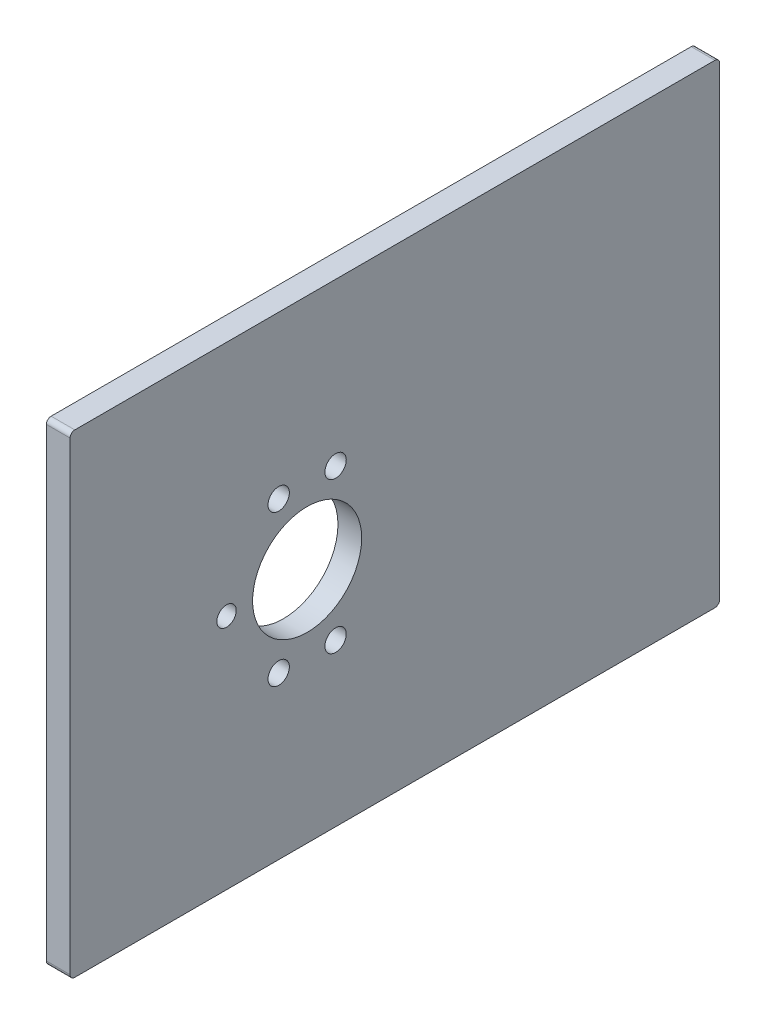
ISO-10303-21;
HEADER;
FILE_DESCRIPTION(('STEP AP214'),'2;1');
FILE_NAME('part.step','',(''),(''),'','','');
FILE_SCHEMA(('AUTOMOTIVE_DESIGN { 1 0 10303 214 1 1 1 1 }'));
ENDSEC;
DATA;
#1=APPLICATION_CONTEXT('core data for automotive mechanical design processes');
#2=APPLICATION_PROTOCOL_DEFINITION('international standard','automotive_design',2000,#1);
#3=PRODUCT_CONTEXT('',#1,'mechanical');
#4=PRODUCT('Part','Part','',(#3));
#5=PRODUCT_RELATED_PRODUCT_CATEGORY('part','',(#4));
#6=PRODUCT_DEFINITION_FORMATION('','',#4);
#7=PRODUCT_DEFINITION_CONTEXT('part definition',#1,'design');
#8=PRODUCT_DEFINITION('design','',#6,#7);
#9=PRODUCT_DEFINITION_SHAPE('','',#8);
#10=(LENGTH_UNIT() NAMED_UNIT(*) SI_UNIT(.MILLI.,.METRE.));
#11=(NAMED_UNIT(*) PLANE_ANGLE_UNIT() SI_UNIT($,.RADIAN.));
#12=(NAMED_UNIT(*) SI_UNIT($,.STERADIAN.) SOLID_ANGLE_UNIT());
#13=UNCERTAINTY_MEASURE_WITH_UNIT(LENGTH_MEASURE(1.E-05),#10,'distance_accuracy_value','');
#14=(GEOMETRIC_REPRESENTATION_CONTEXT(3) GLOBAL_UNCERTAINTY_ASSIGNED_CONTEXT((#13)) GLOBAL_UNIT_ASSIGNED_CONTEXT((#10,
#11,#12)) REPRESENTATION_CONTEXT('',''));
#15=CARTESIAN_POINT('',(0.,0.,0.));
#16=DIRECTION('',(0.,0.,1.));
#17=DIRECTION('',(1.,0.,0.));
#18=AXIS2_PLACEMENT_3D('',#15,#16,#17);
#19=CARTESIAN_POINT('',(5.,0.,0.));
#20=DIRECTION('',(-1.,0.,0.));
#21=DIRECTION('',(0.,0.,1.));
#22=AXIS2_PLACEMENT_3D('',#19,#20,#21);
#23=PLANE('',#22);
#24=DIRECTION('',(0.,1.,0.));
#25=VECTOR('',#24,1.);
#26=CARTESIAN_POINT('',(5.,-40.0918034275328,55.));
#27=LINE('',#26,#25);
#28=CARTESIAN_POINT('',(5.,-39.0918034275328,55.));
#29=VERTEX_POINT('',#28);
#30=CARTESIAN_POINT('',(5.,58.9081965724673,55.));
#31=VERTEX_POINT('',#30);
#32=EDGE_CURVE('E172',#29,#31,#27,.T.);
#33=ORIENTED_EDGE('',*,*,#32,.T.);
#34=CARTESIAN_POINT('',(5.,58.9081965724673,56.));
#35=DIRECTION('',(-1.,0.,0.));
#36=DIRECTION('',(0.,0.,1.));
#37=AXIS2_PLACEMENT_3D('',#34,#35,#36);
#38=CIRCLE('',#37,1.);
#39=CARTESIAN_POINT('',(5.,59.9081965724673,56.));
#40=VERTEX_POINT('',#39);
#41=EDGE_CURVE('E149',#31,#40,#38,.F.);
#42=ORIENTED_EDGE('',*,*,#41,.T.);
#43=DIRECTION('',(0.,0.,1.));
#44=VECTOR('',#43,1.);
#45=CARTESIAN_POINT('',(5.,59.9081965724673,92.));
#46=LINE('',#45,#44);
#47=CARTESIAN_POINT('',(5.,59.9081965724673,191.));
#48=VERTEX_POINT('',#47);
#49=EDGE_CURVE('E120',#40,#48,#46,.T.);
#50=ORIENTED_EDGE('',*,*,#49,.T.);
#51=CARTESIAN_POINT('',(5.,58.9081965724672,191.));
#52=DIRECTION('',(-1.,0.,0.));
#53=DIRECTION('',(0.,0.,1.));
#54=AXIS2_PLACEMENT_3D('',#51,#52,#53);
#55=CIRCLE('',#54,1.);
#56=CARTESIAN_POINT('',(5.,58.9081965724672,192.));
#57=VERTEX_POINT('',#56);
#58=EDGE_CURVE('E145',#48,#57,#55,.F.);
#59=ORIENTED_EDGE('',*,*,#58,.T.);
#60=DIRECTION('',(0.,-1.,0.));
#61=VECTOR('',#60,1.);
#62=CARTESIAN_POINT('',(5.,59.9081965724672,192.));
#63=LINE('',#62,#61);
#64=CARTESIAN_POINT('',(5.,-39.0918034275328,192.));
#65=VERTEX_POINT('',#64);
#66=EDGE_CURVE('E128',#57,#65,#63,.T.);
#67=ORIENTED_EDGE('',*,*,#66,.T.);
#68=CARTESIAN_POINT('',(5.,-39.0918034275328,191.));
#69=DIRECTION('',(-1.,0.,0.));
#70=DIRECTION('',(0.,0.,1.));
#71=AXIS2_PLACEMENT_3D('',#68,#69,#70);
#72=CIRCLE('',#71,1.);
#73=CARTESIAN_POINT('',(5.,-40.0918034275328,191.));
#74=VERTEX_POINT('',#73);
#75=EDGE_CURVE('E55',#65,#74,#72,.F.);
#76=ORIENTED_EDGE('',*,*,#75,.T.);
#77=DIRECTION('',(0.,0.,-1.));
#78=VECTOR('',#77,1.);
#79=CARTESIAN_POINT('',(5.,-40.0918034275328,92.));
#80=LINE('',#79,#78);
#81=CARTESIAN_POINT('',(5.,-40.0918034275328,56.));
#82=VERTEX_POINT('',#81);
#83=EDGE_CURVE('E131',#74,#82,#80,.T.);
#84=ORIENTED_EDGE('',*,*,#83,.T.);
#85=CARTESIAN_POINT('',(5.,-39.0918034275328,56.));
#86=DIRECTION('',(-1.,0.,0.));
#87=DIRECTION('',(0.,0.,1.));
#88=AXIS2_PLACEMENT_3D('',#85,#86,#87);
#89=CIRCLE('',#88,1.);
#90=EDGE_CURVE('E147',#82,#29,#89,.F.);
#91=ORIENTED_EDGE('',*,*,#90,.T.);
#92=EDGE_LOOP('',(#33,#42,#50,#59,#67,#76,#84,#91));
#93=FACE_BOUND('',#92,.T.);
#94=CARTESIAN_POINT('',(5.,9.90819657246723,142.));
#95=DIRECTION('',(1.,0.,0.));
#96=DIRECTION('',(0.,0.,-1.));
#97=AXIS2_PLACEMENT_3D('',#94,#95,#96);
#98=CIRCLE('',#97,11.5);
#99=CARTESIAN_POINT('',(5.,9.90819657246723,130.5));
#100=VERTEX_POINT('',#99);
#101=EDGE_CURVE('E168',#100,#100,#98,.T.);
#102=ORIENTED_EDGE('',*,*,#101,.F.);
#103=EDGE_LOOP('',(#102));
#104=FACE_BOUND('',#103,.T.);
#105=CARTESIAN_POINT('',(5.,25.8141702930541,148.));
#106=DIRECTION('',(1.,0.,0.));
#107=DIRECTION('',(0.,0.,-1.));
#108=AXIS2_PLACEMENT_3D('',#105,#106,#107);
#109=CIRCLE('',#108,2.25000000000001);
#110=CARTESIAN_POINT('',(5.,25.8141702930541,145.75));
#111=VERTEX_POINT('',#110);
#112=EDGE_CURVE('E178',#111,#111,#109,.T.);
#113=ORIENTED_EDGE('',*,*,#112,.F.);
#114=EDGE_LOOP('',(#113));
#115=FACE_BOUND('',#114,.T.);
#116=CARTESIAN_POINT('',(5.,25.8141702930541,136.));
#117=DIRECTION('',(1.,0.,0.));
#118=DIRECTION('',(0.,0.,-1.));
#119=AXIS2_PLACEMENT_3D('',#116,#117,#118);
#120=CIRCLE('',#119,2.25000000000001);
#121=CARTESIAN_POINT('',(5.,25.8141702930541,133.75));
#122=VERTEX_POINT('',#121);
#123=EDGE_CURVE('E184',#122,#122,#120,.T.);
#124=ORIENTED_EDGE('',*,*,#123,.F.);
#125=EDGE_LOOP('',(#124));
#126=FACE_BOUND('',#125,.T.);
#127=CARTESIAN_POINT('',(5.,9.90819657246723,159.));
#128=DIRECTION('',(1.,0.,0.));
#129=DIRECTION('',(0.,0.,-1.));
#130=AXIS2_PLACEMENT_3D('',#127,#128,#129);
#131=CIRCLE('',#130,2.04999999999999);
#132=CARTESIAN_POINT('',(5.,9.90819657246723,156.95));
#133=VERTEX_POINT('',#132);
#134=EDGE_CURVE('E190',#133,#133,#131,.T.);
#135=ORIENTED_EDGE('',*,*,#134,.F.);
#136=EDGE_LOOP('',(#135));
#137=FACE_BOUND('',#136,.T.);
#138=CARTESIAN_POINT('',(5.,-5.99777714811964,148.));
#139=DIRECTION('',(1.,0.,0.));
#140=DIRECTION('',(0.,0.,-1.));
#141=AXIS2_PLACEMENT_3D('',#138,#139,#140);
#142=CIRCLE('',#141,2.25000000000001);
#143=CARTESIAN_POINT('',(5.,-5.99777714811964,145.75));
#144=VERTEX_POINT('',#143);
#145=EDGE_CURVE('E196',#144,#144,#142,.T.);
#146=ORIENTED_EDGE('',*,*,#145,.F.);
#147=EDGE_LOOP('',(#146));
#148=FACE_BOUND('',#147,.T.);
#149=CARTESIAN_POINT('',(5.,-5.99777714811964,136.));
#150=DIRECTION('',(1.,0.,0.));
#151=DIRECTION('',(0.,0.,-1.));
#152=AXIS2_PLACEMENT_3D('',#149,#150,#151);
#153=CIRCLE('',#152,2.25000000000001);
#154=CARTESIAN_POINT('',(5.,-5.99777714811964,133.75));
#155=VERTEX_POINT('',#154);
#156=EDGE_CURVE('E202',#155,#155,#153,.T.);
#157=ORIENTED_EDGE('',*,*,#156,.F.);
#158=EDGE_LOOP('',(#157));
#159=FACE_BOUND('',#158,.T.);
#160=ADVANCED_FACE('F33',(#93,#104,#115,#126,#137,#148,#159),#23,.F.);
#161=CARTESIAN_POINT('',(0.,0.,0.));
#162=DIRECTION('',(-1.,0.,0.));
#163=DIRECTION('',(0.,0.,1.));
#164=AXIS2_PLACEMENT_3D('',#161,#162,#163);
#165=PLANE('',#164);
#166=CARTESIAN_POINT('',(0.,-5.99777714811964,148.));
#167=DIRECTION('',(1.,0.,0.));
#168=DIRECTION('',(0.,0.,-1.));
#169=AXIS2_PLACEMENT_3D('',#166,#167,#168);
#170=CIRCLE('',#169,2.25000000000001);
#171=CARTESIAN_POINT('',(0.,-5.99777714811964,145.75));
#172=VERTEX_POINT('',#171);
#173=EDGE_CURVE('E199',#172,#172,#170,.T.);
#174=ORIENTED_EDGE('',*,*,#173,.T.);
#175=EDGE_LOOP('',(#174));
#176=FACE_BOUND('',#175,.T.);
#177=CARTESIAN_POINT('',(0.,25.8141702930541,136.));
#178=DIRECTION('',(1.,0.,0.));
#179=DIRECTION('',(0.,0.,-1.));
#180=AXIS2_PLACEMENT_3D('',#177,#178,#179);
#181=CIRCLE('',#180,2.25000000000001);
#182=CARTESIAN_POINT('',(0.,25.8141702930541,133.75));
#183=VERTEX_POINT('',#182);
#184=EDGE_CURVE('E187',#183,#183,#181,.T.);
#185=ORIENTED_EDGE('',*,*,#184,.T.);
#186=EDGE_LOOP('',(#185));
#187=FACE_BOUND('',#186,.T.);
#188=CARTESIAN_POINT('',(0.,9.90819657246723,142.));
#189=DIRECTION('',(1.,0.,0.));
#190=DIRECTION('',(0.,0.,-1.));
#191=AXIS2_PLACEMENT_3D('',#188,#189,#190);
#192=CIRCLE('',#191,11.5);
#193=CARTESIAN_POINT('',(0.,9.90819657246723,130.5));
#194=VERTEX_POINT('',#193);
#195=EDGE_CURVE('E175',#194,#194,#192,.T.);
#196=ORIENTED_EDGE('',*,*,#195,.T.);
#197=EDGE_LOOP('',(#196));
#198=FACE_BOUND('',#197,.T.);
#199=DIRECTION('',(0.,0.,1.));
#200=VECTOR('',#199,1.);
#201=CARTESIAN_POINT('',(0.,59.9081965724673,92.));
#202=LINE('',#201,#200);
#203=CARTESIAN_POINT('',(0.,59.9081965724673,56.));
#204=VERTEX_POINT('',#203);
#205=CARTESIAN_POINT('',(0.,59.9081965724672,191.));
#206=VERTEX_POINT('',#205);
#207=EDGE_CURVE('E117',#204,#206,#202,.T.);
#208=ORIENTED_EDGE('',*,*,#207,.F.);
#209=CARTESIAN_POINT('',(0.,58.9081965724673,56.));
#210=DIRECTION('',(-1.,0.,0.));
#211=DIRECTION('',(0.,0.,1.));
#212=AXIS2_PLACEMENT_3D('',#209,#210,#211);
#213=CIRCLE('',#212,1.);
#214=CARTESIAN_POINT('',(0.,58.9081965724673,55.));
#215=VERTEX_POINT('',#214);
#216=EDGE_CURVE('E100',#204,#215,#213,.T.);
#217=ORIENTED_EDGE('',*,*,#216,.T.);
#218=DIRECTION('',(0.,1.,0.));
#219=VECTOR('',#218,1.);
#220=CARTESIAN_POINT('',(0.,-40.0918034275328,55.));
#221=LINE('',#220,#219);
#222=CARTESIAN_POINT('',(0.,-39.0918034275328,55.));
#223=VERTEX_POINT('',#222);
#224=EDGE_CURVE('E129',#223,#215,#221,.T.);
#225=ORIENTED_EDGE('',*,*,#224,.F.);
#226=CARTESIAN_POINT('',(0.,-39.0918034275328,56.));
#227=DIRECTION('',(-1.,0.,0.));
#228=DIRECTION('',(0.,0.,1.));
#229=AXIS2_PLACEMENT_3D('',#226,#227,#228);
#230=CIRCLE('',#229,1.);
#231=CARTESIAN_POINT('',(0.,-40.0918034275328,56.));
#232=VERTEX_POINT('',#231);
#233=EDGE_CURVE('E111',#223,#232,#230,.T.);
#234=ORIENTED_EDGE('',*,*,#233,.T.);
#235=DIRECTION('',(0.,0.,-1.));
#236=VECTOR('',#235,1.);
#237=CARTESIAN_POINT('',(0.,-40.0918034275328,92.));
#238=LINE('',#237,#236);
#239=CARTESIAN_POINT('',(0.,-40.0918034275328,191.));
#240=VERTEX_POINT('',#239);
#241=EDGE_CURVE('E133',#240,#232,#238,.T.);
#242=ORIENTED_EDGE('',*,*,#241,.F.);
#243=CARTESIAN_POINT('',(0.,-39.0918034275328,191.));
#244=DIRECTION('',(-1.,0.,0.));
#245=DIRECTION('',(0.,0.,1.));
#246=AXIS2_PLACEMENT_3D('',#243,#244,#245);
#247=CIRCLE('',#246,1.);
#248=CARTESIAN_POINT('',(0.,-39.0918034275328,192.));
#249=VERTEX_POINT('',#248);
#250=EDGE_CURVE('E121',#240,#249,#247,.T.);
#251=ORIENTED_EDGE('',*,*,#250,.T.);
#252=DIRECTION('',(0.,-1.,0.));
#253=VECTOR('',#252,1.);
#254=CARTESIAN_POINT('',(0.,59.9081965724672,192.));
#255=LINE('',#254,#253);
#256=CARTESIAN_POINT('',(0.,58.9081965724672,192.));
#257=VERTEX_POINT('',#256);
#258=EDGE_CURVE('E160',#257,#249,#255,.T.);
#259=ORIENTED_EDGE('',*,*,#258,.F.);
#260=CARTESIAN_POINT('',(0.,58.9081965724672,191.));
#261=DIRECTION('',(-1.,0.,0.));
#262=DIRECTION('',(0.,0.,1.));
#263=AXIS2_PLACEMENT_3D('',#260,#261,#262);
#264=CIRCLE('',#263,1.);
#265=EDGE_CURVE('E127',#257,#206,#264,.T.);
#266=ORIENTED_EDGE('',*,*,#265,.T.);
#267=EDGE_LOOP('',(#208,#217,#225,#234,#242,#251,#259,#266));
#268=FACE_BOUND('',#267,.T.);
#269=CARTESIAN_POINT('',(0.,25.8141702930541,148.));
#270=DIRECTION('',(1.,0.,0.));
#271=DIRECTION('',(0.,0.,-1.));
#272=AXIS2_PLACEMENT_3D('',#269,#270,#271);
#273=CIRCLE('',#272,2.25000000000001);
#274=CARTESIAN_POINT('',(0.,25.8141702930541,145.75));
#275=VERTEX_POINT('',#274);
#276=EDGE_CURVE('E181',#275,#275,#273,.T.);
#277=ORIENTED_EDGE('',*,*,#276,.T.);
#278=EDGE_LOOP('',(#277));
#279=FACE_BOUND('',#278,.T.);
#280=CARTESIAN_POINT('',(0.,9.90819657246723,159.));
#281=DIRECTION('',(1.,0.,0.));
#282=DIRECTION('',(0.,0.,-1.));
#283=AXIS2_PLACEMENT_3D('',#280,#281,#282);
#284=CIRCLE('',#283,2.04999999999999);
#285=CARTESIAN_POINT('',(0.,9.90819657246723,156.95));
#286=VERTEX_POINT('',#285);
#287=EDGE_CURVE('E193',#286,#286,#284,.T.);
#288=ORIENTED_EDGE('',*,*,#287,.T.);
#289=EDGE_LOOP('',(#288));
#290=FACE_BOUND('',#289,.T.);
#291=CARTESIAN_POINT('',(0.,-5.99777714811964,136.));
#292=DIRECTION('',(1.,0.,0.));
#293=DIRECTION('',(0.,0.,-1.));
#294=AXIS2_PLACEMENT_3D('',#291,#292,#293);
#295=CIRCLE('',#294,2.25000000000001);
#296=CARTESIAN_POINT('',(0.,-5.99777714811964,133.75));
#297=VERTEX_POINT('',#296);
#298=EDGE_CURVE('E205',#297,#297,#295,.T.);
#299=ORIENTED_EDGE('',*,*,#298,.T.);
#300=EDGE_LOOP('',(#299));
#301=FACE_BOUND('',#300,.T.);
#302=ADVANCED_FACE('F124',(#176,#187,#198,#268,#279,#290,#301),#165,.T.);
#303=CARTESIAN_POINT('',(5.,59.9081965724672,192.));
#304=DIRECTION('',(0.,0.,-1.));
#305=DIRECTION('',(-1.,0.,0.));
#306=AXIS2_PLACEMENT_3D('',#303,#304,#305);
#307=PLANE('',#306);
#308=ORIENTED_EDGE('',*,*,#66,.F.);
#309=DIRECTION('',(-1.,0.,0.));
#310=VECTOR('',#309,1.);
#311=CARTESIAN_POINT('',(5.,58.9081965724672,192.));
#312=LINE('',#311,#310);
#313=EDGE_CURVE('E11',#57,#257,#312,.T.);
#314=ORIENTED_EDGE('',*,*,#313,.T.);
#315=ORIENTED_EDGE('',*,*,#258,.T.);
#316=DIRECTION('',(-1.,0.,0.));
#317=VECTOR('',#316,1.);
#318=CARTESIAN_POINT('',(5.,-39.0918034275328,192.));
#319=LINE('',#318,#317);
#320=EDGE_CURVE('E41',#249,#65,#319,.F.);
#321=ORIENTED_EDGE('',*,*,#320,.T.);
#322=EDGE_LOOP('',(#308,#314,#315,#321));
#323=FACE_BOUND('',#322,.T.);
#324=ADVANCED_FACE('F158',(#323),#307,.F.);
#325=CARTESIAN_POINT('',(5.,-40.0918034275328,92.));
#326=DIRECTION('',(0.,1.,0.));
#327=DIRECTION('',(0.,0.,1.));
#328=AXIS2_PLACEMENT_3D('',#325,#326,#327);
#329=PLANE('',#328);
#330=ORIENTED_EDGE('',*,*,#241,.T.);
#331=DIRECTION('',(-1.,0.,0.));
#332=VECTOR('',#331,1.);
#333=CARTESIAN_POINT('',(5.,-40.0918034275328,56.));
#334=LINE('',#333,#332);
#335=EDGE_CURVE('E48',#232,#82,#334,.F.);
#336=ORIENTED_EDGE('',*,*,#335,.T.);
#337=ORIENTED_EDGE('',*,*,#83,.F.);
#338=DIRECTION('',(-1.,0.,0.));
#339=VECTOR('',#338,1.);
#340=CARTESIAN_POINT('',(5.,-40.0918034275328,191.));
#341=LINE('',#340,#339);
#342=EDGE_CURVE('E151',#74,#240,#341,.T.);
#343=ORIENTED_EDGE('',*,*,#342,.T.);
#344=EDGE_LOOP('',(#330,#336,#337,#343));
#345=FACE_BOUND('',#344,.T.);
#346=ADVANCED_FACE('F167',(#345),#329,.F.);
#347=CARTESIAN_POINT('',(5.,-40.0918034275328,55.));
#348=DIRECTION('',(0.,0.,1.));
#349=DIRECTION('',(1.,0.,0.));
#350=AXIS2_PLACEMENT_3D('',#347,#348,#349);
#351=PLANE('',#350);
#352=ORIENTED_EDGE('',*,*,#224,.T.);
#353=DIRECTION('',(-1.,0.,0.));
#354=VECTOR('',#353,1.);
#355=CARTESIAN_POINT('',(5.,58.9081965724673,55.));
#356=LINE('',#355,#354);
#357=EDGE_CURVE('E105',#215,#31,#356,.F.);
#358=ORIENTED_EDGE('',*,*,#357,.T.);
#359=ORIENTED_EDGE('',*,*,#32,.F.);
#360=DIRECTION('',(-1.,0.,0.));
#361=VECTOR('',#360,1.);
#362=CARTESIAN_POINT('',(5.,-39.0918034275328,55.));
#363=LINE('',#362,#361);
#364=EDGE_CURVE('E110',#29,#223,#363,.T.);
#365=ORIENTED_EDGE('',*,*,#364,.T.);
#366=EDGE_LOOP('',(#352,#358,#359,#365));
#367=FACE_BOUND('',#366,.T.);
#368=ADVANCED_FACE('F228',(#367),#351,.F.);
#369=CARTESIAN_POINT('',(5.,59.9081965724673,92.));
#370=DIRECTION('',(0.,-1.,0.));
#371=DIRECTION('',(0.,0.,-1.));
#372=AXIS2_PLACEMENT_3D('',#369,#370,#371);
#373=PLANE('',#372);
#374=ORIENTED_EDGE('',*,*,#49,.F.);
#375=DIRECTION('',(-1.,0.,0.));
#376=VECTOR('',#375,1.);
#377=CARTESIAN_POINT('',(5.,59.9081965724673,56.));
#378=LINE('',#377,#376);
#379=EDGE_CURVE('E104',#40,#204,#378,.T.);
#380=ORIENTED_EDGE('',*,*,#379,.T.);
#381=ORIENTED_EDGE('',*,*,#207,.T.);
#382=DIRECTION('',(-1.,0.,0.));
#383=VECTOR('',#382,1.);
#384=CARTESIAN_POINT('',(5.,59.9081965724672,191.));
#385=LINE('',#384,#383);
#386=EDGE_CURVE('E122',#206,#48,#385,.F.);
#387=ORIENTED_EDGE('',*,*,#386,.T.);
#388=EDGE_LOOP('',(#374,#380,#381,#387));
#389=FACE_BOUND('',#388,.T.);
#390=ADVANCED_FACE('F116',(#389),#373,.F.);
#391=CARTESIAN_POINT('',(5.,9.90819657246723,142.));
#392=DIRECTION('',(-1.,0.,0.));
#393=DIRECTION('',(0.,0.,1.));
#394=AXIS2_PLACEMENT_3D('',#391,#392,#393);
#395=CYLINDRICAL_SURFACE('',#394,11.5);
#396=ORIENTED_EDGE('',*,*,#101,.T.);
#397=EDGE_LOOP('',(#396));
#398=FACE_BOUND('',#397,.T.);
#399=ORIENTED_EDGE('',*,*,#195,.F.);
#400=EDGE_LOOP('',(#399));
#401=FACE_BOUND('',#400,.T.);
#402=ADVANCED_FACE('F223',(#398,#401),#395,.F.);
#403=CARTESIAN_POINT('',(5.,25.8141702930541,148.));
#404=DIRECTION('',(-1.,0.,0.));
#405=DIRECTION('',(0.,0.,1.));
#406=AXIS2_PLACEMENT_3D('',#403,#404,#405);
#407=CYLINDRICAL_SURFACE('',#406,2.25000000000001);
#408=ORIENTED_EDGE('',*,*,#112,.T.);
#409=EDGE_LOOP('',(#408));
#410=FACE_BOUND('',#409,.T.);
#411=ORIENTED_EDGE('',*,*,#276,.F.);
#412=EDGE_LOOP('',(#411));
#413=FACE_BOUND('',#412,.T.);
#414=ADVANCED_FACE('F320',(#410,#413),#407,.F.);
#415=CARTESIAN_POINT('',(5.,25.8141702930541,136.));
#416=DIRECTION('',(-1.,0.,0.));
#417=DIRECTION('',(0.,0.,1.));
#418=AXIS2_PLACEMENT_3D('',#415,#416,#417);
#419=CYLINDRICAL_SURFACE('',#418,2.25000000000001);
#420=ORIENTED_EDGE('',*,*,#123,.T.);
#421=EDGE_LOOP('',(#420));
#422=FACE_BOUND('',#421,.T.);
#423=ORIENTED_EDGE('',*,*,#184,.F.);
#424=EDGE_LOOP('',(#423));
#425=FACE_BOUND('',#424,.T.);
#426=ADVANCED_FACE('F328',(#422,#425),#419,.F.);
#427=CARTESIAN_POINT('',(5.,9.90819657246723,159.));
#428=DIRECTION('',(-1.,0.,0.));
#429=DIRECTION('',(0.,0.,1.));
#430=AXIS2_PLACEMENT_3D('',#427,#428,#429);
#431=CYLINDRICAL_SURFACE('',#430,2.04999999999999);
#432=ORIENTED_EDGE('',*,*,#134,.T.);
#433=EDGE_LOOP('',(#432));
#434=FACE_BOUND('',#433,.T.);
#435=ORIENTED_EDGE('',*,*,#287,.F.);
#436=EDGE_LOOP('',(#435));
#437=FACE_BOUND('',#436,.T.);
#438=ADVANCED_FACE('F336',(#434,#437),#431,.F.);
#439=CARTESIAN_POINT('',(5.,-5.99777714811964,148.));
#440=DIRECTION('',(-1.,0.,0.));
#441=DIRECTION('',(0.,0.,1.));
#442=AXIS2_PLACEMENT_3D('',#439,#440,#441);
#443=CYLINDRICAL_SURFACE('',#442,2.25000000000001);
#444=ORIENTED_EDGE('',*,*,#145,.T.);
#445=EDGE_LOOP('',(#444));
#446=FACE_BOUND('',#445,.T.);
#447=ORIENTED_EDGE('',*,*,#173,.F.);
#448=EDGE_LOOP('',(#447));
#449=FACE_BOUND('',#448,.T.);
#450=ADVANCED_FACE('F345',(#446,#449),#443,.F.);
#451=CARTESIAN_POINT('',(5.,-5.99777714811964,136.));
#452=DIRECTION('',(-1.,0.,0.));
#453=DIRECTION('',(0.,0.,1.));
#454=AXIS2_PLACEMENT_3D('',#451,#452,#453);
#455=CYLINDRICAL_SURFACE('',#454,2.25000000000001);
#456=ORIENTED_EDGE('',*,*,#156,.T.);
#457=EDGE_LOOP('',(#456));
#458=FACE_BOUND('',#457,.T.);
#459=ORIENTED_EDGE('',*,*,#298,.F.);
#460=EDGE_LOOP('',(#459));
#461=FACE_BOUND('',#460,.T.);
#462=ADVANCED_FACE('F211',(#458,#461),#455,.F.);
#463=CARTESIAN_POINT('',(5.,58.9081965724673,56.));
#464=DIRECTION('',(-1.,0.,0.));
#465=DIRECTION('',(0.,0.,1.));
#466=AXIS2_PLACEMENT_3D('',#463,#464,#465);
#467=CYLINDRICAL_SURFACE('',#466,1.);
#468=ORIENTED_EDGE('',*,*,#41,.F.);
#469=ORIENTED_EDGE('',*,*,#357,.F.);
#470=ORIENTED_EDGE('',*,*,#216,.F.);
#471=ORIENTED_EDGE('',*,*,#379,.F.);
#472=EDGE_LOOP('',(#468,#469,#470,#471));
#473=FACE_BOUND('',#472,.T.);
#474=ADVANCED_FACE('F103',(#473),#467,.T.);
#475=CARTESIAN_POINT('',(5.,-39.0918034275328,56.));
#476=DIRECTION('',(-1.,0.,0.));
#477=DIRECTION('',(0.,0.,1.));
#478=AXIS2_PLACEMENT_3D('',#475,#476,#477);
#479=CYLINDRICAL_SURFACE('',#478,1.);
#480=ORIENTED_EDGE('',*,*,#90,.F.);
#481=ORIENTED_EDGE('',*,*,#335,.F.);
#482=ORIENTED_EDGE('',*,*,#233,.F.);
#483=ORIENTED_EDGE('',*,*,#364,.F.);
#484=EDGE_LOOP('',(#480,#481,#482,#483));
#485=FACE_BOUND('',#484,.T.);
#486=ADVANCED_FACE('F238',(#485),#479,.T.);
#487=CARTESIAN_POINT('',(5.,58.9081965724672,191.));
#488=DIRECTION('',(-1.,0.,0.));
#489=DIRECTION('',(0.,0.,1.));
#490=AXIS2_PLACEMENT_3D('',#487,#488,#489);
#491=CYLINDRICAL_SURFACE('',#490,1.);
#492=ORIENTED_EDGE('',*,*,#58,.F.);
#493=ORIENTED_EDGE('',*,*,#386,.F.);
#494=ORIENTED_EDGE('',*,*,#265,.F.);
#495=ORIENTED_EDGE('',*,*,#313,.F.);
#496=EDGE_LOOP('',(#492,#493,#494,#495));
#497=FACE_BOUND('',#496,.T.);
#498=ADVANCED_FACE('F240',(#497),#491,.T.);
#499=CARTESIAN_POINT('',(5.,-39.0918034275328,191.));
#500=DIRECTION('',(-1.,0.,0.));
#501=DIRECTION('',(0.,0.,1.));
#502=AXIS2_PLACEMENT_3D('',#499,#500,#501);
#503=CYLINDRICAL_SURFACE('',#502,1.);
#504=ORIENTED_EDGE('',*,*,#75,.F.);
#505=ORIENTED_EDGE('',*,*,#320,.F.);
#506=ORIENTED_EDGE('',*,*,#250,.F.);
#507=ORIENTED_EDGE('',*,*,#342,.F.);
#508=EDGE_LOOP('',(#504,#505,#506,#507));
#509=FACE_BOUND('',#508,.T.);
#510=ADVANCED_FACE('F35',(#509),#503,.T.);
#511=CLOSED_SHELL('',(#160,#302,#324,#346,#368,#390,#402,#414,#426,#438,#450,#462,#474,#486,
#498,#510));
#512=MANIFOLD_SOLID_BREP('B2',#511);
#513=ADVANCED_BREP_SHAPE_REPRESENTATION('',(#18,#512),#14);
#514=SHAPE_DEFINITION_REPRESENTATION(#9,#513);
ENDSEC;
END-ISO-10303-21;
